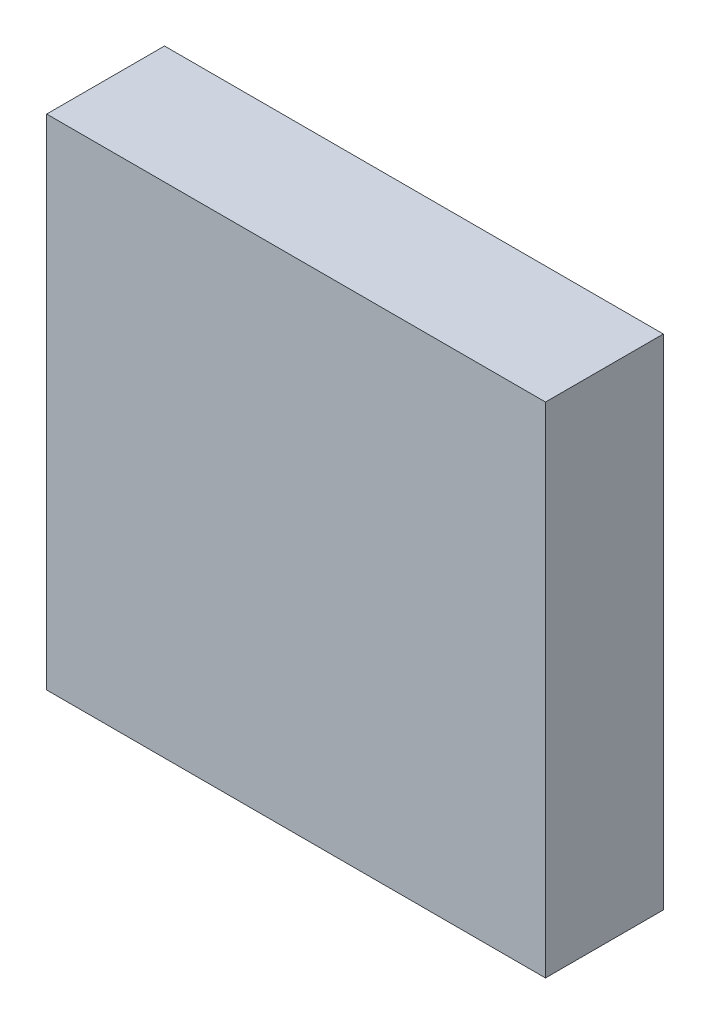
ISO-10303-21;
HEADER;
FILE_DESCRIPTION(('STEP AP214'),'2;1');
FILE_NAME('part.step','',(''),(''),'','','');
FILE_SCHEMA(('AUTOMOTIVE_DESIGN { 1 0 10303 214 1 1 1 1 }'));
ENDSEC;
DATA;
#1=APPLICATION_CONTEXT('core data for automotive mechanical design processes');
#2=APPLICATION_PROTOCOL_DEFINITION('international standard','automotive_design',2000,#1);
#3=PRODUCT_CONTEXT('',#1,'mechanical');
#4=PRODUCT('Part','Part','',(#3));
#5=PRODUCT_RELATED_PRODUCT_CATEGORY('part','',(#4));
#6=PRODUCT_DEFINITION_FORMATION('','',#4);
#7=PRODUCT_DEFINITION_CONTEXT('part definition',#1,'design');
#8=PRODUCT_DEFINITION('design','',#6,#7);
#9=PRODUCT_DEFINITION_SHAPE('','',#8);
#10=(LENGTH_UNIT() NAMED_UNIT(*) SI_UNIT(.MILLI.,.METRE.));
#11=(NAMED_UNIT(*) PLANE_ANGLE_UNIT() SI_UNIT($,.RADIAN.));
#12=(NAMED_UNIT(*) SI_UNIT($,.STERADIAN.) SOLID_ANGLE_UNIT());
#13=UNCERTAINTY_MEASURE_WITH_UNIT(LENGTH_MEASURE(1.E-05),#10,'distance_accuracy_value','');
#14=(GEOMETRIC_REPRESENTATION_CONTEXT(3) GLOBAL_UNCERTAINTY_ASSIGNED_CONTEXT((#13)) GLOBAL_UNIT_ASSIGNED_CONTEXT((#10,
#11,#12)) REPRESENTATION_CONTEXT('',''));
#15=CARTESIAN_POINT('',(0.,0.,0.));
#16=DIRECTION('',(0.,0.,1.));
#17=DIRECTION('',(1.,0.,0.));
#18=AXIS2_PLACEMENT_3D('',#15,#16,#17);
#19=CARTESIAN_POINT('',(12.7,12.7,6.));
#20=DIRECTION('',(-1.,0.,0.));
#21=DIRECTION('',(0.,-1.,0.));
#22=AXIS2_PLACEMENT_3D('',#19,#20,#21);
#23=PLANE('',#22);
#24=DIRECTION('',(0.,1.,0.));
#25=VECTOR('',#24,1.);
#26=CARTESIAN_POINT('',(12.7,12.7,0.));
#27=LINE('',#26,#25);
#28=CARTESIAN_POINT('',(12.7,-12.7,0.));
#29=VERTEX_POINT('',#28);
#30=CARTESIAN_POINT('',(12.7,12.7,0.));
#31=VERTEX_POINT('',#30);
#32=EDGE_CURVE('E98',#29,#31,#27,.T.);
#33=ORIENTED_EDGE('',*,*,#32,.T.);
#34=DIRECTION('',(0.,0.,-1.));
#35=VECTOR('',#34,1.);
#36=CARTESIAN_POINT('',(12.7,12.7,6.));
#37=LINE('',#36,#35);
#38=CARTESIAN_POINT('',(12.7,12.7,6.));
#39=VERTEX_POINT('',#38);
#40=EDGE_CURVE('E11',#39,#31,#37,.T.);
#41=ORIENTED_EDGE('',*,*,#40,.F.);
#42=DIRECTION('',(0.,1.,0.));
#43=VECTOR('',#42,1.);
#44=CARTESIAN_POINT('',(12.7,12.7,6.));
#45=LINE('',#44,#43);
#46=CARTESIAN_POINT('',(12.7,-12.7,6.));
#47=VERTEX_POINT('',#46);
#48=EDGE_CURVE('E86',#47,#39,#45,.T.);
#49=ORIENTED_EDGE('',*,*,#48,.F.);
#50=DIRECTION('',(0.,0.,-1.));
#51=VECTOR('',#50,1.);
#52=CARTESIAN_POINT('',(12.7,-12.7,6.));
#53=LINE('',#52,#51);
#54=EDGE_CURVE('E94',#47,#29,#53,.T.);
#55=ORIENTED_EDGE('',*,*,#54,.T.);
#56=EDGE_LOOP('',(#33,#41,#49,#55));
#57=FACE_BOUND('',#56,.T.);
#58=ADVANCED_FACE('F35',(#57),#23,.F.);
#59=CARTESIAN_POINT('',(-12.7,12.7,6.));
#60=DIRECTION('',(0.,-1.,0.));
#61=DIRECTION('',(0.,0.,-1.));
#62=AXIS2_PLACEMENT_3D('',#59,#60,#61);
#63=PLANE('',#62);
#64=DIRECTION('',(-1.,0.,0.));
#65=VECTOR('',#64,1.);
#66=CARTESIAN_POINT('',(-12.7,12.7,0.));
#67=LINE('',#66,#65);
#68=CARTESIAN_POINT('',(-12.7,12.7,0.));
#69=VERTEX_POINT('',#68);
#70=EDGE_CURVE('E90',#31,#69,#67,.T.);
#71=ORIENTED_EDGE('',*,*,#70,.T.);
#72=DIRECTION('',(0.,0.,-1.));
#73=VECTOR('',#72,1.);
#74=CARTESIAN_POINT('',(-12.7,12.7,6.));
#75=LINE('',#74,#73);
#76=CARTESIAN_POINT('',(-12.7,12.7,6.));
#77=VERTEX_POINT('',#76);
#78=EDGE_CURVE('E43',#77,#69,#75,.T.);
#79=ORIENTED_EDGE('',*,*,#78,.F.);
#80=DIRECTION('',(-1.,0.,0.));
#81=VECTOR('',#80,1.);
#82=CARTESIAN_POINT('',(-12.7,12.7,6.));
#83=LINE('',#82,#81);
#84=EDGE_CURVE('E81',#39,#77,#83,.T.);
#85=ORIENTED_EDGE('',*,*,#84,.F.);
#86=ORIENTED_EDGE('',*,*,#40,.T.);
#87=EDGE_LOOP('',(#71,#79,#85,#86));
#88=FACE_BOUND('',#87,.T.);
#89=ADVANCED_FACE('F89',(#88),#63,.F.);
#90=CARTESIAN_POINT('',(-12.7,12.7,6.));
#91=DIRECTION('',(1.,0.,0.));
#92=DIRECTION('',(0.,1.,0.));
#93=AXIS2_PLACEMENT_3D('',#90,#91,#92);
#94=PLANE('',#93);
#95=DIRECTION('',(0.,-1.,0.));
#96=VECTOR('',#95,1.);
#97=CARTESIAN_POINT('',(-12.7,12.7,0.));
#98=LINE('',#97,#96);
#99=CARTESIAN_POINT('',(-12.7,-12.7,0.));
#100=VERTEX_POINT('',#99);
#101=EDGE_CURVE('E68',#69,#100,#98,.T.);
#102=ORIENTED_EDGE('',*,*,#101,.T.);
#103=DIRECTION('',(0.,0.,-1.));
#104=VECTOR('',#103,1.);
#105=CARTESIAN_POINT('',(-12.7,-12.7,6.));
#106=LINE('',#105,#104);
#107=CARTESIAN_POINT('',(-12.7,-12.7,6.));
#108=VERTEX_POINT('',#107);
#109=EDGE_CURVE('E91',#108,#100,#106,.T.);
#110=ORIENTED_EDGE('',*,*,#109,.F.);
#111=DIRECTION('',(0.,-1.,0.));
#112=VECTOR('',#111,1.);
#113=CARTESIAN_POINT('',(-12.7,12.7,6.));
#114=LINE('',#113,#112);
#115=EDGE_CURVE('E84',#77,#108,#114,.T.);
#116=ORIENTED_EDGE('',*,*,#115,.F.);
#117=ORIENTED_EDGE('',*,*,#78,.T.);
#118=EDGE_LOOP('',(#102,#110,#116,#117));
#119=FACE_BOUND('',#118,.T.);
#120=ADVANCED_FACE('F92',(#119),#94,.F.);
#121=CARTESIAN_POINT('',(-12.7,-12.7,6.));
#122=DIRECTION('',(0.,1.,0.));
#123=DIRECTION('',(0.,0.,1.));
#124=AXIS2_PLACEMENT_3D('',#121,#122,#123);
#125=PLANE('',#124);
#126=DIRECTION('',(1.,0.,0.));
#127=VECTOR('',#126,1.);
#128=CARTESIAN_POINT('',(-12.7,-12.7,0.));
#129=LINE('',#128,#127);
#130=EDGE_CURVE('E74',#100,#29,#129,.T.);
#131=ORIENTED_EDGE('',*,*,#130,.T.);
#132=ORIENTED_EDGE('',*,*,#54,.F.);
#133=DIRECTION('',(1.,0.,0.));
#134=VECTOR('',#133,1.);
#135=CARTESIAN_POINT('',(-12.7,-12.7,6.));
#136=LINE('',#135,#134);
#137=EDGE_CURVE('E51',#108,#47,#136,.T.);
#138=ORIENTED_EDGE('',*,*,#137,.F.);
#139=ORIENTED_EDGE('',*,*,#109,.T.);
#140=EDGE_LOOP('',(#131,#132,#138,#139));
#141=FACE_BOUND('',#140,.T.);
#142=ADVANCED_FACE('F105',(#141),#125,.F.);
#143=CARTESIAN_POINT('',(0.,0.,6.));
#144=DIRECTION('',(0.,0.,1.));
#145=DIRECTION('',(1.,0.,0.));
#146=AXIS2_PLACEMENT_3D('',#143,#144,#145);
#147=PLANE('',#146);
#148=ORIENTED_EDGE('',*,*,#48,.T.);
#149=ORIENTED_EDGE('',*,*,#84,.T.);
#150=ORIENTED_EDGE('',*,*,#115,.T.);
#151=ORIENTED_EDGE('',*,*,#137,.T.);
#152=EDGE_LOOP('',(#148,#149,#150,#151));
#153=FACE_BOUND('',#152,.T.);
#154=ADVANCED_FACE('F82',(#153),#147,.T.);
#155=CARTESIAN_POINT('',(0.,0.,0.));
#156=DIRECTION('',(0.,0.,1.));
#157=DIRECTION('',(1.,0.,0.));
#158=AXIS2_PLACEMENT_3D('',#155,#156,#157);
#159=PLANE('',#158);
#160=ORIENTED_EDGE('',*,*,#32,.F.);
#161=ORIENTED_EDGE('',*,*,#130,.F.);
#162=ORIENTED_EDGE('',*,*,#101,.F.);
#163=ORIENTED_EDGE('',*,*,#70,.F.);
#164=EDGE_LOOP('',(#160,#161,#162,#163));
#165=FACE_BOUND('',#164,.T.);
#166=ADVANCED_FACE('F108',(#165),#159,.F.);
#167=CLOSED_SHELL('',(#58,#89,#120,#142,#154,#166));
#168=MANIFOLD_SOLID_BREP('B2',#167);
#169=ADVANCED_BREP_SHAPE_REPRESENTATION('',(#18,#168),#14);
#170=SHAPE_DEFINITION_REPRESENTATION(#9,#169);
ENDSEC;
END-ISO-10303-21;
